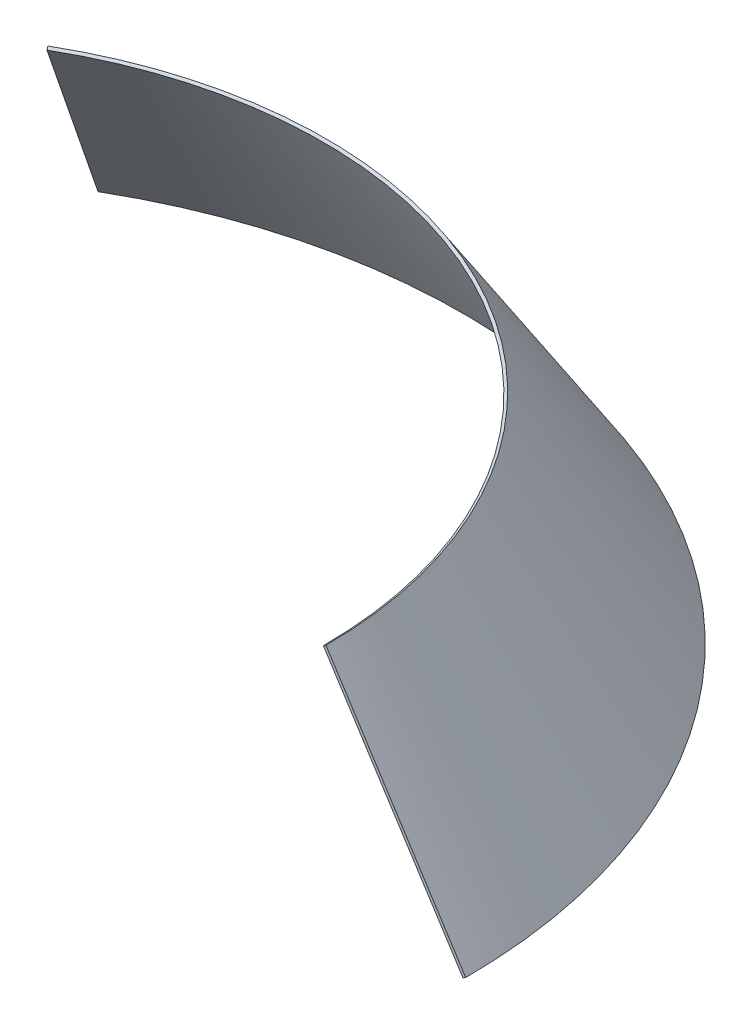
ISO-10303-21;
HEADER;
FILE_DESCRIPTION(('STEP AP214'),'2;1');
FILE_NAME('part.step','',(''),(''),'','','');
FILE_SCHEMA(('AUTOMOTIVE_DESIGN { 1 0 10303 214 1 1 1 1 }'));
ENDSEC;
DATA;
#1=APPLICATION_CONTEXT('core data for automotive mechanical design processes');
#2=APPLICATION_PROTOCOL_DEFINITION('international standard','automotive_design',2000,#1);
#3=PRODUCT_CONTEXT('',#1,'mechanical');
#4=PRODUCT('Part','Part','',(#3));
#5=PRODUCT_RELATED_PRODUCT_CATEGORY('part','',(#4));
#6=PRODUCT_DEFINITION_FORMATION('','',#4);
#7=PRODUCT_DEFINITION_CONTEXT('part definition',#1,'design');
#8=PRODUCT_DEFINITION('design','',#6,#7);
#9=PRODUCT_DEFINITION_SHAPE('','',#8);
#10=(LENGTH_UNIT() NAMED_UNIT(*) SI_UNIT(.MILLI.,.METRE.));
#11=(NAMED_UNIT(*) PLANE_ANGLE_UNIT() SI_UNIT($,.RADIAN.));
#12=(NAMED_UNIT(*) SI_UNIT($,.STERADIAN.) SOLID_ANGLE_UNIT());
#13=UNCERTAINTY_MEASURE_WITH_UNIT(LENGTH_MEASURE(1.E-05),#10,'distance_accuracy_value','');
#14=(GEOMETRIC_REPRESENTATION_CONTEXT(3) GLOBAL_UNCERTAINTY_ASSIGNED_CONTEXT((#13)) GLOBAL_UNIT_ASSIGNED_CONTEXT((#10,
#11,#12)) REPRESENTATION_CONTEXT('',''));
#15=CARTESIAN_POINT('',(0.,0.,0.));
#16=DIRECTION('',(0.,0.,1.));
#17=DIRECTION('',(1.,0.,0.));
#18=AXIS2_PLACEMENT_3D('',#15,#16,#17);
#19=CARTESIAN_POINT('',(0.,0.269733685716838,0.));
#20=DIRECTION('',(0.,-1.,0.));
#21=DIRECTION('',(0.,0.,-1.));
#22=AXIS2_PLACEMENT_3D('',#19,#20,#21);
#23=CONICAL_SURFACE('',#22,90.9578135180633,0.569804410513442);
#24=CARTESIAN_POINT('',(0.,0.269733685716838,0.));
#25=DIRECTION('',(0.,-1.,0.));
#26=DIRECTION('',(0.,0.,-1.));
#27=AXIS2_PLACEMENT_3D('',#24,#25,#26);
#28=CIRCLE('',#27,90.9578135180633);
#29=CARTESIAN_POINT('',(-45.478906759032,0.269733685716838,-78.7717771793303));
#30=VERTEX_POINT('',#29);
#31=CARTESIAN_POINT('',(90.9578135180633,0.269733685716838,0.));
#32=VERTEX_POINT('',#31);
#33=EDGE_CURVE('E11',#30,#32,#28,.T.);
#34=ORIENTED_EDGE('',*,*,#33,.F.);
#35=DIRECTION('',(0.26973368571684,0.842006505413373,0.467192448174378));
#36=VECTOR('',#35,1.);
#37=CARTESIAN_POINT('',(-45.478906759032,0.269733685716838,-78.7717771793303));
#38=LINE('',#37,#36);
#39=CARTESIAN_POINT('',(-34.4957527268411,34.5549847862044,-59.7483963682209));
#40=VERTEX_POINT('',#39);
#41=EDGE_CURVE('E73',#30,#40,#38,.T.);
#42=ORIENTED_EDGE('',*,*,#41,.T.);
#43=CARTESIAN_POINT('',(0.,34.5549847862044,0.));
#44=DIRECTION('',(0.,-1.,0.));
#45=DIRECTION('',(0.,0.,-1.));
#46=AXIS2_PLACEMENT_3D('',#43,#44,#45);
#47=CIRCLE('',#46,68.9915054536817);
#48=CARTESIAN_POINT('',(68.9915054536817,34.5549847862044,0.));
#49=VERTEX_POINT('',#48);
#50=EDGE_CURVE('E68',#40,#49,#47,.T.);
#51=ORIENTED_EDGE('',*,*,#50,.T.);
#52=DIRECTION('',(-0.539467371433676,0.842006505413373,0.));
#53=VECTOR('',#52,1.);
#54=CARTESIAN_POINT('',(90.9578135180633,0.269733685716838,0.));
#55=LINE('',#54,#53);
#56=EDGE_CURVE('E71',#32,#49,#55,.T.);
#57=ORIENTED_EDGE('',*,*,#56,.F.);
#58=EDGE_LOOP('',(#34,#42,#51,#57));
#59=FACE_BOUND('',#58,.T.);
#60=ADVANCED_FACE('F32',(#59),#23,.T.);
#61=CARTESIAN_POINT('',(0.,0.269733685716838,0.));
#62=DIRECTION('',(0.,1.,0.));
#63=DIRECTION('',(0.,0.,1.));
#64=AXIS2_PLACEMENT_3D('',#61,#62,#63);
#65=CONICAL_SURFACE('',#64,90.9578135180633,1.00099191628146);
#66=CARTESIAN_POINT('',(0.,0.,0.));
#67=DIRECTION('',(0.,-1.,0.));
#68=DIRECTION('',(0.,0.,-1.));
#69=AXIS2_PLACEMENT_3D('',#66,#67,#68);
#70=CIRCLE('',#69,90.5368102653566);
#71=CARTESIAN_POINT('',(-45.2684051326787,0.,-78.4071776674104));
#72=VERTEX_POINT('',#71);
#73=CARTESIAN_POINT('',(90.5368102653566,0.,0.));
#74=VERTEX_POINT('',#73);
#75=EDGE_CURVE('E40',#72,#74,#70,.T.);
#76=ORIENTED_EDGE('',*,*,#75,.F.);
#77=DIRECTION('',(0.421003252706691,-0.539467371433671,0.729199023839741));
#78=VECTOR('',#77,1.);
#79=CARTESIAN_POINT('',(-45.478906759032,0.269733685716838,-78.7717771793303));
#80=LINE('',#79,#78);
#81=EDGE_CURVE('E78',#30,#72,#80,.T.);
#82=ORIENTED_EDGE('',*,*,#81,.F.);
#83=ORIENTED_EDGE('',*,*,#33,.T.);
#84=DIRECTION('',(-0.842006505413376,-0.539467371433671,0.));
#85=VECTOR('',#84,1.);
#86=CARTESIAN_POINT('',(90.9578135180633,0.269733685716838,0.));
#87=LINE('',#86,#85);
#88=EDGE_CURVE('E90',#32,#74,#87,.T.);
#89=ORIENTED_EDGE('',*,*,#88,.T.);
#90=EDGE_LOOP('',(#76,#82,#83,#89));
#91=FACE_BOUND('',#90,.T.);
#92=ADVANCED_FACE('F34',(#91),#65,.T.);
#93=CARTESIAN_POINT('',(0.,0.,0.));
#94=DIRECTION('',(0.,-1.,0.));
#95=DIRECTION('',(0.,0.,-1.));
#96=AXIS2_PLACEMENT_3D('',#93,#94,#95);
#97=CONICAL_SURFACE('',#96,90.5368102653566,0.569804410513442);
#98=CARTESIAN_POINT('',(0.,34.2852511004875,0.));
#99=DIRECTION('',(0.,-1.,0.));
#100=DIRECTION('',(0.,0.,-1.));
#101=AXIS2_PLACEMENT_3D('',#98,#99,#100);
#102=CIRCLE('',#101,68.570502200975);
#103=CARTESIAN_POINT('',(-34.2852511004878,34.2852511004875,-59.383796856301));
#104=VERTEX_POINT('',#103);
#105=CARTESIAN_POINT('',(68.570502200975,34.2852511004875,0.));
#106=VERTEX_POINT('',#105);
#107=EDGE_CURVE('E77',#104,#106,#102,.T.);
#108=ORIENTED_EDGE('',*,*,#107,.F.);
#109=DIRECTION('',(0.26973368571684,0.842006505413373,0.467192448174378));
#110=VECTOR('',#109,1.);
#111=CARTESIAN_POINT('',(-45.2684051326787,0.,-78.4071776674104));
#112=LINE('',#111,#110);
#113=EDGE_CURVE('E98',#72,#104,#112,.T.);
#114=ORIENTED_EDGE('',*,*,#113,.F.);
#115=ORIENTED_EDGE('',*,*,#75,.T.);
#116=DIRECTION('',(-0.539467371433676,0.842006505413373,0.));
#117=VECTOR('',#116,1.);
#118=CARTESIAN_POINT('',(90.5368102653566,0.,0.));
#119=LINE('',#118,#117);
#120=EDGE_CURVE('E86',#74,#106,#119,.T.);
#121=ORIENTED_EDGE('',*,*,#120,.T.);
#122=EDGE_LOOP('',(#108,#114,#115,#121));
#123=FACE_BOUND('',#122,.T.);
#124=ADVANCED_FACE('F104',(#123),#97,.F.);
#125=CARTESIAN_POINT('',(0.,34.2852511004875,0.));
#126=DIRECTION('',(0.,1.,0.));
#127=DIRECTION('',(0.,0.,1.));
#128=AXIS2_PLACEMENT_3D('',#125,#126,#127);
#129=CONICAL_SURFACE('',#128,68.570502200975,1.00099191628146);
#130=DIRECTION('',(-0.421003252706691,0.539467371433672,-0.729199023839741));
#131=VECTOR('',#130,1.);
#132=CARTESIAN_POINT('',(-34.2852511004878,34.2852511004875,-59.383796856301));
#133=LINE('',#132,#131);
#134=EDGE_CURVE('E96',#104,#40,#133,.T.);
#135=ORIENTED_EDGE('',*,*,#134,.F.);
#136=ORIENTED_EDGE('',*,*,#107,.T.);
#137=DIRECTION('',(0.842006505413375,0.539467371433672,0.));
#138=VECTOR('',#137,1.);
#139=CARTESIAN_POINT('',(68.570502200975,34.2852511004875,0.));
#140=LINE('',#139,#138);
#141=EDGE_CURVE('E81',#106,#49,#140,.T.);
#142=ORIENTED_EDGE('',*,*,#141,.T.);
#143=ORIENTED_EDGE('',*,*,#50,.F.);
#144=EDGE_LOOP('',(#135,#136,#142,#143));
#145=FACE_BOUND('',#144,.T.);
#146=ADVANCED_FACE('F82',(#145),#129,.F.);
#147=CARTESIAN_POINT('',(0.,0.,0.));
#148=DIRECTION('',(-0.866025403784436,0.,0.500000000000004));
#149=DIRECTION('',(0.500000000000004,0.,0.866025403784436));
#150=AXIS2_PLACEMENT_3D('',#147,#148,#149);
#151=PLANE('',#150);
#152=ORIENTED_EDGE('',*,*,#41,.F.);
#153=ORIENTED_EDGE('',*,*,#81,.T.);
#154=ORIENTED_EDGE('',*,*,#113,.T.);
#155=ORIENTED_EDGE('',*,*,#134,.T.);
#156=EDGE_LOOP('',(#152,#153,#154,#155));
#157=FACE_BOUND('',#156,.T.);
#158=ADVANCED_FACE('F106',(#157),#151,.T.);
#159=CARTESIAN_POINT('',(0.,0.,0.));
#160=DIRECTION('',(0.,0.,-1.));
#161=DIRECTION('',(-1.,0.,0.));
#162=AXIS2_PLACEMENT_3D('',#159,#160,#161);
#163=PLANE('',#162);
#164=ORIENTED_EDGE('',*,*,#56,.T.);
#165=ORIENTED_EDGE('',*,*,#141,.F.);
#166=ORIENTED_EDGE('',*,*,#120,.F.);
#167=ORIENTED_EDGE('',*,*,#88,.F.);
#168=EDGE_LOOP('',(#164,#165,#166,#167));
#169=FACE_BOUND('',#168,.T.);
#170=ADVANCED_FACE('F89',(#169),#163,.F.);
#171=CLOSED_SHELL('',(#60,#92,#124,#146,#158,#170));
#172=MANIFOLD_SOLID_BREP('B2',#171);
#173=ADVANCED_BREP_SHAPE_REPRESENTATION('',(#18,#172),#14);
#174=SHAPE_DEFINITION_REPRESENTATION(#9,#173);
ENDSEC;
END-ISO-10303-21;
